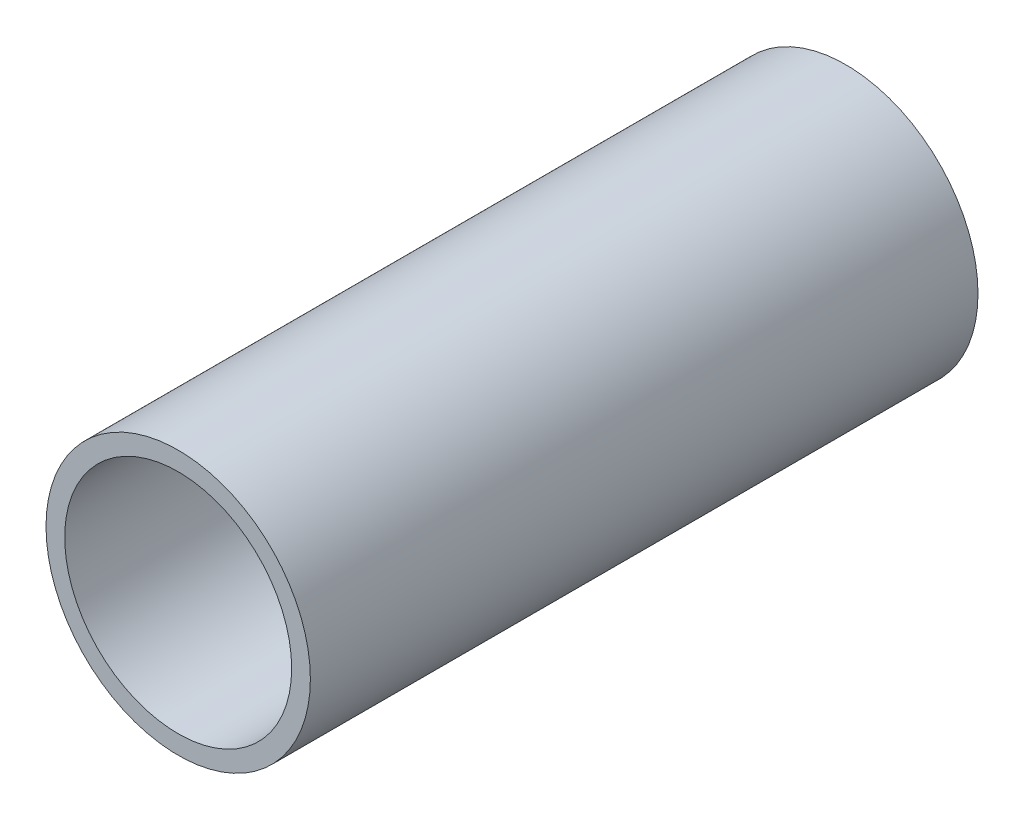
ISO-10303-21;
HEADER;
FILE_DESCRIPTION(('STEP AP214'),'2;1');
FILE_NAME('part.step','',(''),(''),'','','');
FILE_SCHEMA(('AUTOMOTIVE_DESIGN { 1 0 10303 214 1 1 1 1 }'));
ENDSEC;
DATA;
#1=APPLICATION_CONTEXT('core data for automotive mechanical design processes');
#2=APPLICATION_PROTOCOL_DEFINITION('international standard','automotive_design',2000,#1);
#3=PRODUCT_CONTEXT('',#1,'mechanical');
#4=PRODUCT('Part','Part','',(#3));
#5=PRODUCT_RELATED_PRODUCT_CATEGORY('part','',(#4));
#6=PRODUCT_DEFINITION_FORMATION('','',#4);
#7=PRODUCT_DEFINITION_CONTEXT('part definition',#1,'design');
#8=PRODUCT_DEFINITION('design','',#6,#7);
#9=PRODUCT_DEFINITION_SHAPE('','',#8);
#10=(LENGTH_UNIT() NAMED_UNIT(*) SI_UNIT(.MILLI.,.METRE.));
#11=(NAMED_UNIT(*) PLANE_ANGLE_UNIT() SI_UNIT($,.RADIAN.));
#12=(NAMED_UNIT(*) SI_UNIT($,.STERADIAN.) SOLID_ANGLE_UNIT());
#13=UNCERTAINTY_MEASURE_WITH_UNIT(LENGTH_MEASURE(1.E-05),#10,'distance_accuracy_value','');
#14=(GEOMETRIC_REPRESENTATION_CONTEXT(3) GLOBAL_UNCERTAINTY_ASSIGNED_CONTEXT((#13)) GLOBAL_UNIT_ASSIGNED_CONTEXT((#10,
#11,#12)) REPRESENTATION_CONTEXT('',''));
#15=CARTESIAN_POINT('',(0.,0.,0.));
#16=DIRECTION('',(0.,0.,1.));
#17=DIRECTION('',(1.,0.,0.));
#18=AXIS2_PLACEMENT_3D('',#15,#16,#17);
#19=CARTESIAN_POINT('',(0.,0.,63.5));
#20=DIRECTION('',(0.,0.,1.));
#21=DIRECTION('',(1.,0.,0.));
#22=AXIS2_PLACEMENT_3D('',#19,#20,#21);
#23=PLANE('',#22);
#24=CARTESIAN_POINT('',(0.,0.,63.5));
#25=DIRECTION('',(0.,0.,1.));
#26=DIRECTION('',(1.,0.,0.));
#27=AXIS2_PLACEMENT_3D('',#24,#25,#26);
#28=CIRCLE('',#27,12.573);
#29=CARTESIAN_POINT('',(12.573,0.,63.5));
#30=VERTEX_POINT('',#29);
#31=EDGE_CURVE('E10',#30,#30,#28,.T.);
#32=ORIENTED_EDGE('',*,*,#31,.T.);
#33=EDGE_LOOP('',(#32));
#34=FACE_BOUND('',#33,.T.);
#35=CARTESIAN_POINT('',(0.,0.,63.5));
#36=DIRECTION('',(0.,0.,1.));
#37=DIRECTION('',(1.,0.,0.));
#38=AXIS2_PLACEMENT_3D('',#35,#36,#37);
#39=CIRCLE('',#38,10.795);
#40=CARTESIAN_POINT('',(10.795,0.,63.5));
#41=VERTEX_POINT('',#40);
#42=EDGE_CURVE('E41',#41,#41,#39,.T.);
#43=ORIENTED_EDGE('',*,*,#42,.F.);
#44=EDGE_LOOP('',(#43));
#45=FACE_BOUND('',#44,.T.);
#46=ADVANCED_FACE('F30',(#34,#45),#23,.T.);
#47=CARTESIAN_POINT('',(0.,0.,0.));
#48=DIRECTION('',(0.,0.,1.));
#49=DIRECTION('',(1.,0.,0.));
#50=AXIS2_PLACEMENT_3D('',#47,#48,#49);
#51=PLANE('',#50);
#52=CARTESIAN_POINT('',(0.,0.,0.));
#53=DIRECTION('',(0.,0.,1.));
#54=DIRECTION('',(1.,0.,0.));
#55=AXIS2_PLACEMENT_3D('',#52,#53,#54);
#56=CIRCLE('',#55,12.573);
#57=CARTESIAN_POINT('',(12.573,0.,0.));
#58=VERTEX_POINT('',#57);
#59=EDGE_CURVE('E34',#58,#58,#56,.T.);
#60=ORIENTED_EDGE('',*,*,#59,.F.);
#61=EDGE_LOOP('',(#60));
#62=FACE_BOUND('',#61,.T.);
#63=CARTESIAN_POINT('',(0.,0.,0.));
#64=DIRECTION('',(0.,0.,1.));
#65=DIRECTION('',(1.,0.,0.));
#66=AXIS2_PLACEMENT_3D('',#63,#64,#65);
#67=CIRCLE('',#66,10.795);
#68=CARTESIAN_POINT('',(10.795,0.,0.));
#69=VERTEX_POINT('',#68);
#70=EDGE_CURVE('E43',#69,#69,#67,.T.);
#71=ORIENTED_EDGE('',*,*,#70,.T.);
#72=EDGE_LOOP('',(#71));
#73=FACE_BOUND('',#72,.T.);
#74=ADVANCED_FACE('F53',(#62,#73),#51,.F.);
#75=CARTESIAN_POINT('',(0.,0.,63.5));
#76=DIRECTION('',(0.,0.,-1.));
#77=DIRECTION('',(-1.,0.,0.));
#78=AXIS2_PLACEMENT_3D('',#75,#76,#77);
#79=CYLINDRICAL_SURFACE('',#78,12.573);
#80=ORIENTED_EDGE('',*,*,#31,.F.);
#81=EDGE_LOOP('',(#80));
#82=FACE_BOUND('',#81,.T.);
#83=ORIENTED_EDGE('',*,*,#59,.T.);
#84=EDGE_LOOP('',(#83));
#85=FACE_BOUND('',#84,.T.);
#86=ADVANCED_FACE('F32',(#82,#85),#79,.T.);
#87=CARTESIAN_POINT('',(0.,0.,63.5));
#88=DIRECTION('',(0.,0.,-1.));
#89=DIRECTION('',(-1.,0.,0.));
#90=AXIS2_PLACEMENT_3D('',#87,#88,#89);
#91=CYLINDRICAL_SURFACE('',#90,10.795);
#92=ORIENTED_EDGE('',*,*,#42,.T.);
#93=EDGE_LOOP('',(#92));
#94=FACE_BOUND('',#93,.T.);
#95=ORIENTED_EDGE('',*,*,#70,.F.);
#96=EDGE_LOOP('',(#95));
#97=FACE_BOUND('',#96,.T.);
#98=ADVANCED_FACE('F49',(#94,#97),#91,.F.);
#99=CLOSED_SHELL('',(#46,#74,#86,#98));
#100=MANIFOLD_SOLID_BREP('B2',#99);
#101=ADVANCED_BREP_SHAPE_REPRESENTATION('',(#18,#100),#14);
#102=SHAPE_DEFINITION_REPRESENTATION(#9,#101);
ENDSEC;
END-ISO-10303-21;
